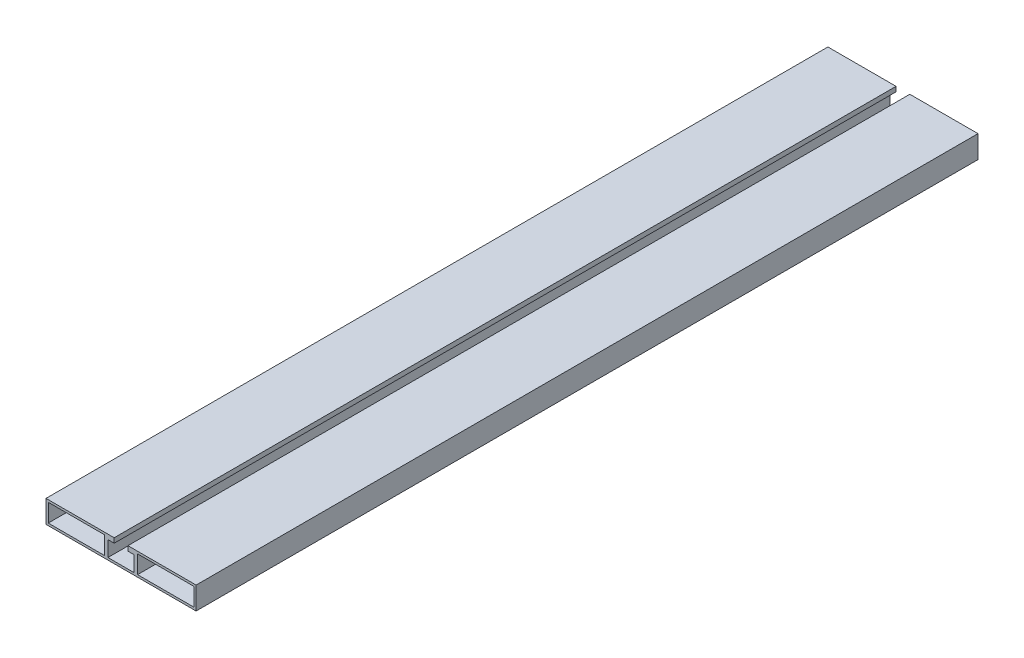
ISO-10303-21;
HEADER;
FILE_DESCRIPTION(('STEP AP214'),'2;1');
FILE_NAME('part.step','',(''),(''),'','','');
FILE_SCHEMA(('AUTOMOTIVE_DESIGN { 1 0 10303 214 1 1 1 1 }'));
ENDSEC;
DATA;
#1=APPLICATION_CONTEXT('core data for automotive mechanical design processes');
#2=APPLICATION_PROTOCOL_DEFINITION('international standard','automotive_design',2000,#1);
#3=PRODUCT_CONTEXT('',#1,'mechanical');
#4=PRODUCT('Part','Part','',(#3));
#5=PRODUCT_RELATED_PRODUCT_CATEGORY('part','',(#4));
#6=PRODUCT_DEFINITION_FORMATION('','',#4);
#7=PRODUCT_DEFINITION_CONTEXT('part definition',#1,'design');
#8=PRODUCT_DEFINITION('design','',#6,#7);
#9=PRODUCT_DEFINITION_SHAPE('','',#8);
#10=(LENGTH_UNIT() NAMED_UNIT(*) SI_UNIT(.MILLI.,.METRE.));
#11=(NAMED_UNIT(*) PLANE_ANGLE_UNIT() SI_UNIT($,.RADIAN.));
#12=(NAMED_UNIT(*) SI_UNIT($,.STERADIAN.) SOLID_ANGLE_UNIT());
#13=UNCERTAINTY_MEASURE_WITH_UNIT(LENGTH_MEASURE(1.E-05),#10,'distance_accuracy_value','');
#14=(GEOMETRIC_REPRESENTATION_CONTEXT(3) GLOBAL_UNCERTAINTY_ASSIGNED_CONTEXT((#13)) GLOBAL_UNIT_ASSIGNED_CONTEXT((#10,
#11,#12)) REPRESENTATION_CONTEXT('',''));
#15=CARTESIAN_POINT('',(0.,0.,0.));
#16=DIRECTION('',(0.,0.,1.));
#17=DIRECTION('',(1.,0.,0.));
#18=AXIS2_PLACEMENT_3D('',#15,#16,#17);
#19=CARTESIAN_POINT('',(59.9999999999999,-9.00000000000001,625.));
#20=DIRECTION('',(0.,1.,0.));
#21=DIRECTION('',(0.,0.,1.));
#22=AXIS2_PLACEMENT_3D('',#19,#20,#21);
#23=PLANE('',#22);
#24=CARTESIAN_POINT('',(0.,-9.00000000000001,603.));
#25=DIRECTION('',(0.,-1.,0.));
#26=DIRECTION('',(0.,0.,-1.));
#27=AXIS2_PLACEMENT_3D('',#24,#25,#26);
#28=CIRCLE('',#27,2.6);
#29=CARTESIAN_POINT('',(0.,-9.00000000000001,600.4));
#30=VERTEX_POINT('',#29);
#31=EDGE_CURVE('E663',#30,#30,#28,.T.);
#32=ORIENTED_EDGE('',*,*,#31,.F.);
#33=EDGE_LOOP('',(#32));
#34=FACE_BOUND('',#33,.T.);
#35=DIRECTION('',(1.,0.,0.));
#36=VECTOR('',#35,1.);
#37=CARTESIAN_POINT('',(59.9999999999999,-9.00000000000001,0.));
#38=LINE('',#37,#36);
#39=CARTESIAN_POINT('',(-60.0000000000001,-9.00000000000001,0.));
#40=VERTEX_POINT('',#39);
#41=CARTESIAN_POINT('',(59.9999999999999,-9.00000000000001,0.));
#42=VERTEX_POINT('',#41);
#43=EDGE_CURVE('E313',#40,#42,#38,.T.);
#44=ORIENTED_EDGE('',*,*,#43,.T.);
#45=DIRECTION('',(0.,0.,-1.));
#46=VECTOR('',#45,1.);
#47=CARTESIAN_POINT('',(59.9999999999999,-9.00000000000001,625.));
#48=LINE('',#47,#46);
#49=CARTESIAN_POINT('',(59.9999999999999,-9.00000000000001,625.));
#50=VERTEX_POINT('',#49);
#51=EDGE_CURVE('E48',#50,#42,#48,.T.);
#52=ORIENTED_EDGE('',*,*,#51,.F.);
#53=DIRECTION('',(1.,0.,0.));
#54=VECTOR('',#53,1.);
#55=CARTESIAN_POINT('',(59.9999999999999,-9.00000000000001,625.));
#56=LINE('',#55,#54);
#57=CARTESIAN_POINT('',(-60.0000000000001,-9.00000000000001,625.));
#58=VERTEX_POINT('',#57);
#59=EDGE_CURVE('E275',#58,#50,#56,.T.);
#60=ORIENTED_EDGE('',*,*,#59,.F.);
#61=DIRECTION('',(0.,0.,-1.));
#62=VECTOR('',#61,1.);
#63=CARTESIAN_POINT('',(-60.0000000000001,-9.00000000000001,625.));
#64=LINE('',#63,#62);
#65=EDGE_CURVE('E11',#58,#40,#64,.T.);
#66=ORIENTED_EDGE('',*,*,#65,.T.);
#67=EDGE_LOOP('',(#44,#52,#60,#66));
#68=FACE_BOUND('',#67,.T.);
#69=CARTESIAN_POINT('',(0.,-9.00000000000001,22.));
#70=DIRECTION('',(0.,-1.,0.));
#71=DIRECTION('',(0.,0.,-1.));
#72=AXIS2_PLACEMENT_3D('',#69,#70,#71);
#73=CIRCLE('',#72,2.6);
#74=CARTESIAN_POINT('',(0.,-9.00000000000001,19.4));
#75=VERTEX_POINT('',#74);
#76=EDGE_CURVE('E658',#75,#75,#73,.T.);
#77=ORIENTED_EDGE('',*,*,#76,.F.);
#78=EDGE_LOOP('',(#77));
#79=FACE_BOUND('',#78,.T.);
#80=ADVANCED_FACE('F39',(#34,#68,#79),#23,.F.);
#81=CARTESIAN_POINT('',(0.,0.,625.));
#82=DIRECTION('',(0.,0.,-1.));
#83=DIRECTION('',(-1.,0.,0.));
#84=AXIS2_PLACEMENT_3D('',#81,#82,#83);
#85=PLANE('',#84);
#86=DIRECTION('',(-1.,0.,0.));
#87=VECTOR('',#86,1.);
#88=CARTESIAN_POINT('',(-13.2000000000001,7.2,625.));
#89=LINE('',#88,#87);
#90=CARTESIAN_POINT('',(-13.2000000000001,7.2,625.));
#91=VERTEX_POINT('',#90);
#92=CARTESIAN_POINT('',(-58.2000000000001,7.2,625.));
#93=VERTEX_POINT('',#92);
#94=EDGE_CURVE('E228',#91,#93,#89,.T.);
#95=ORIENTED_EDGE('',*,*,#94,.F.);
#96=DIRECTION('',(0.,1.,0.));
#97=VECTOR('',#96,1.);
#98=CARTESIAN_POINT('',(-13.2000000000001,-7.2,625.));
#99=LINE('',#98,#97);
#100=CARTESIAN_POINT('',(-13.2000000000001,-7.2,625.));
#101=VERTEX_POINT('',#100);
#102=EDGE_CURVE('E239',#101,#91,#99,.T.);
#103=ORIENTED_EDGE('',*,*,#102,.F.);
#104=DIRECTION('',(1.,0.,0.));
#105=VECTOR('',#104,1.);
#106=CARTESIAN_POINT('',(-13.2000000000001,-7.2,625.));
#107=LINE('',#106,#105);
#108=CARTESIAN_POINT('',(-58.2000000000001,-7.2,625.));
#109=VERTEX_POINT('',#108);
#110=EDGE_CURVE('E235',#109,#101,#107,.T.);
#111=ORIENTED_EDGE('',*,*,#110,.F.);
#112=DIRECTION('',(0.,-1.,0.));
#113=VECTOR('',#112,1.);
#114=CARTESIAN_POINT('',(-58.2000000000001,-7.2,625.));
#115=LINE('',#114,#113);
#116=EDGE_CURVE('E231',#93,#109,#115,.T.);
#117=ORIENTED_EDGE('',*,*,#116,.F.);
#118=EDGE_LOOP('',(#95,#103,#111,#117));
#119=FACE_BOUND('',#118,.T.);
#120=DIRECTION('',(0.,-1.,0.));
#121=VECTOR('',#120,1.);
#122=CARTESIAN_POINT('',(-60.0000000000001,8.99999999999999,625.));
#123=LINE('',#122,#121);
#124=CARTESIAN_POINT('',(-60.0000000000001,8.99999999999999,625.));
#125=VERTEX_POINT('',#124);
#126=EDGE_CURVE('E271',#125,#58,#123,.T.);
#127=ORIENTED_EDGE('',*,*,#126,.T.);
#128=ORIENTED_EDGE('',*,*,#59,.T.);
#129=DIRECTION('',(0.,1.,0.));
#130=VECTOR('',#129,1.);
#131=CARTESIAN_POINT('',(60.,8.99999999999999,625.));
#132=LINE('',#131,#130);
#133=CARTESIAN_POINT('',(60.,8.99999999999999,625.));
#134=VERTEX_POINT('',#133);
#135=EDGE_CURVE('E279',#50,#134,#132,.T.);
#136=ORIENTED_EDGE('',*,*,#135,.T.);
#137=DIRECTION('',(-1.,0.,0.));
#138=VECTOR('',#137,1.);
#139=CARTESIAN_POINT('',(60.,8.99999999999999,625.));
#140=LINE('',#139,#138);
#141=CARTESIAN_POINT('',(5.49999999999992,9.,625.));
#142=VERTEX_POINT('',#141);
#143=EDGE_CURVE('E282',#134,#142,#140,.T.);
#144=ORIENTED_EDGE('',*,*,#143,.T.);
#145=DIRECTION('',(0.,-1.,0.));
#146=VECTOR('',#145,1.);
#147=CARTESIAN_POINT('',(5.49999999999992,9.,625.));
#148=LINE('',#147,#146);
#149=CARTESIAN_POINT('',(5.49999999999992,5.19999999999999,625.));
#150=VERTEX_POINT('',#149);
#151=EDGE_CURVE('E285',#142,#150,#148,.T.);
#152=ORIENTED_EDGE('',*,*,#151,.T.);
#153=DIRECTION('',(1.,0.,0.));
#154=VECTOR('',#153,1.);
#155=CARTESIAN_POINT('',(5.49999999999992,5.19999999999999,625.));
#156=LINE('',#155,#154);
#157=CARTESIAN_POINT('',(10.5,5.2,625.));
#158=VERTEX_POINT('',#157);
#159=EDGE_CURVE('E288',#150,#158,#156,.T.);
#160=ORIENTED_EDGE('',*,*,#159,.T.);
#161=DIRECTION('',(0.,-1.,0.));
#162=VECTOR('',#161,1.);
#163=CARTESIAN_POINT('',(10.5,5.2,625.));
#164=LINE('',#163,#162);
#165=CARTESIAN_POINT('',(10.5,-7.2,625.));
#166=VERTEX_POINT('',#165);
#167=EDGE_CURVE('E291',#158,#166,#164,.T.);
#168=ORIENTED_EDGE('',*,*,#167,.T.);
#169=DIRECTION('',(-1.,0.,0.));
#170=VECTOR('',#169,1.);
#171=CARTESIAN_POINT('',(-10.5000000000001,-7.2,625.));
#172=LINE('',#171,#170);
#173=CARTESIAN_POINT('',(-10.5000000000001,-7.2,625.));
#174=VERTEX_POINT('',#173);
#175=EDGE_CURVE('E294',#166,#174,#172,.T.);
#176=ORIENTED_EDGE('',*,*,#175,.T.);
#177=DIRECTION('',(0.,1.,0.));
#178=VECTOR('',#177,1.);
#179=CARTESIAN_POINT('',(-10.5000000000001,5.2,625.));
#180=LINE('',#179,#178);
#181=CARTESIAN_POINT('',(-10.5000000000001,5.2,625.));
#182=VERTEX_POINT('',#181);
#183=EDGE_CURVE('E297',#174,#182,#180,.T.);
#184=ORIENTED_EDGE('',*,*,#183,.T.);
#185=DIRECTION('',(1.,0.,0.));
#186=VECTOR('',#185,1.);
#187=CARTESIAN_POINT('',(-5.50000000000007,5.19999999999999,625.));
#188=LINE('',#187,#186);
#189=CARTESIAN_POINT('',(-5.50000000000007,5.19999999999999,625.));
#190=VERTEX_POINT('',#189);
#191=EDGE_CURVE('E300',#182,#190,#188,.T.);
#192=ORIENTED_EDGE('',*,*,#191,.T.);
#193=DIRECTION('',(0.,1.,0.));
#194=VECTOR('',#193,1.);
#195=CARTESIAN_POINT('',(-5.50000000000008,9.,625.));
#196=LINE('',#195,#194);
#197=CARTESIAN_POINT('',(-5.50000000000008,9.,625.));
#198=VERTEX_POINT('',#197);
#199=EDGE_CURVE('E303',#190,#198,#196,.T.);
#200=ORIENTED_EDGE('',*,*,#199,.T.);
#201=DIRECTION('',(-1.,0.,0.));
#202=VECTOR('',#201,1.);
#203=CARTESIAN_POINT('',(-5.50000000000008,9.,625.));
#204=LINE('',#203,#202);
#205=EDGE_CURVE('E306',#198,#125,#204,.T.);
#206=ORIENTED_EDGE('',*,*,#205,.T.);
#207=EDGE_LOOP('',(#127,#128,#136,#144,#152,#160,#168,#176,#184,#192,#200,#206));
#208=FACE_BOUND('',#207,.T.);
#209=DIRECTION('',(1.,0.,0.));
#210=VECTOR('',#209,1.);
#211=CARTESIAN_POINT('',(13.2,-7.2,625.));
#212=LINE('',#211,#210);
#213=CARTESIAN_POINT('',(13.2,-7.2,625.));
#214=VERTEX_POINT('',#213);
#215=CARTESIAN_POINT('',(58.1999999999999,-7.2,625.));
#216=VERTEX_POINT('',#215);
#217=EDGE_CURVE('E177',#214,#216,#212,.T.);
#218=ORIENTED_EDGE('',*,*,#217,.F.);
#219=DIRECTION('',(0.,-1.,0.));
#220=VECTOR('',#219,1.);
#221=CARTESIAN_POINT('',(13.2,-7.2,625.));
#222=LINE('',#221,#220);
#223=CARTESIAN_POINT('',(13.2,7.2,625.));
#224=VERTEX_POINT('',#223);
#225=EDGE_CURVE('E204',#224,#214,#222,.T.);
#226=ORIENTED_EDGE('',*,*,#225,.F.);
#227=DIRECTION('',(-1.,0.,0.));
#228=VECTOR('',#227,1.);
#229=CARTESIAN_POINT('',(13.2,7.2,625.));
#230=LINE('',#229,#228);
#231=CARTESIAN_POINT('',(58.1999999999999,7.2,625.));
#232=VERTEX_POINT('',#231);
#233=EDGE_CURVE('E200',#232,#224,#230,.T.);
#234=ORIENTED_EDGE('',*,*,#233,.F.);
#235=DIRECTION('',(0.,1.,0.));
#236=VECTOR('',#235,1.);
#237=CARTESIAN_POINT('',(58.1999999999999,-7.2,625.));
#238=LINE('',#237,#236);
#239=EDGE_CURVE('E186',#216,#232,#238,.T.);
#240=ORIENTED_EDGE('',*,*,#239,.F.);
#241=EDGE_LOOP('',(#218,#226,#234,#240));
#242=FACE_BOUND('',#241,.T.);
#243=ADVANCED_FACE('F199',(#119,#208,#242),#85,.F.);
#244=CARTESIAN_POINT('',(0.,0.,0.));
#245=DIRECTION('',(0.,0.,-1.));
#246=DIRECTION('',(-1.,0.,0.));
#247=AXIS2_PLACEMENT_3D('',#244,#245,#246);
#248=PLANE('',#247);
#249=DIRECTION('',(0.,-1.,0.));
#250=VECTOR('',#249,1.);
#251=CARTESIAN_POINT('',(-60.0000000000001,8.99999999999999,0.));
#252=LINE('',#251,#250);
#253=CARTESIAN_POINT('',(-60.0000000000001,8.99999999999999,0.));
#254=VERTEX_POINT('',#253);
#255=EDGE_CURVE('E270',#254,#40,#252,.T.);
#256=ORIENTED_EDGE('',*,*,#255,.F.);
#257=DIRECTION('',(-1.,0.,0.));
#258=VECTOR('',#257,1.);
#259=CARTESIAN_POINT('',(-5.50000000000008,9.,0.));
#260=LINE('',#259,#258);
#261=CARTESIAN_POINT('',(-5.50000000000008,9.,0.));
#262=VERTEX_POINT('',#261);
#263=EDGE_CURVE('E276',#262,#254,#260,.T.);
#264=ORIENTED_EDGE('',*,*,#263,.F.);
#265=DIRECTION('',(0.,1.,0.));
#266=VECTOR('',#265,1.);
#267=CARTESIAN_POINT('',(-5.50000000000008,9.,0.));
#268=LINE('',#267,#266);
#269=CARTESIAN_POINT('',(-5.50000000000007,5.19999999999999,0.));
#270=VERTEX_POINT('',#269);
#271=EDGE_CURVE('E340',#270,#262,#268,.T.);
#272=ORIENTED_EDGE('',*,*,#271,.F.);
#273=DIRECTION('',(1.,0.,0.));
#274=VECTOR('',#273,1.);
#275=CARTESIAN_POINT('',(-5.50000000000007,5.19999999999999,0.));
#276=LINE('',#275,#274);
#277=CARTESIAN_POINT('',(-10.5000000000001,5.2,0.));
#278=VERTEX_POINT('',#277);
#279=EDGE_CURVE('E337',#278,#270,#276,.T.);
#280=ORIENTED_EDGE('',*,*,#279,.F.);
#281=DIRECTION('',(0.,1.,0.));
#282=VECTOR('',#281,1.);
#283=CARTESIAN_POINT('',(-10.5000000000001,5.2,0.));
#284=LINE('',#283,#282);
#285=CARTESIAN_POINT('',(-10.5000000000001,-7.2,0.));
#286=VERTEX_POINT('',#285);
#287=EDGE_CURVE('E334',#286,#278,#284,.T.);
#288=ORIENTED_EDGE('',*,*,#287,.F.);
#289=DIRECTION('',(-1.,0.,0.));
#290=VECTOR('',#289,1.);
#291=CARTESIAN_POINT('',(-10.5000000000001,-7.2,0.));
#292=LINE('',#291,#290);
#293=CARTESIAN_POINT('',(10.5,-7.2,0.));
#294=VERTEX_POINT('',#293);
#295=EDGE_CURVE('E331',#294,#286,#292,.T.);
#296=ORIENTED_EDGE('',*,*,#295,.F.);
#297=DIRECTION('',(0.,-1.,0.));
#298=VECTOR('',#297,1.);
#299=CARTESIAN_POINT('',(10.5,5.2,0.));
#300=LINE('',#299,#298);
#301=CARTESIAN_POINT('',(10.5,5.2,0.));
#302=VERTEX_POINT('',#301);
#303=EDGE_CURVE('E328',#302,#294,#300,.T.);
#304=ORIENTED_EDGE('',*,*,#303,.F.);
#305=DIRECTION('',(1.,0.,0.));
#306=VECTOR('',#305,1.);
#307=CARTESIAN_POINT('',(5.49999999999992,5.19999999999999,0.));
#308=LINE('',#307,#306);
#309=CARTESIAN_POINT('',(5.49999999999992,5.19999999999999,0.));
#310=VERTEX_POINT('',#309);
#311=EDGE_CURVE('E325',#310,#302,#308,.T.);
#312=ORIENTED_EDGE('',*,*,#311,.F.);
#313=DIRECTION('',(0.,-1.,0.));
#314=VECTOR('',#313,1.);
#315=CARTESIAN_POINT('',(5.49999999999992,9.,0.));
#316=LINE('',#315,#314);
#317=CARTESIAN_POINT('',(5.49999999999992,9.,0.));
#318=VERTEX_POINT('',#317);
#319=EDGE_CURVE('E322',#318,#310,#316,.T.);
#320=ORIENTED_EDGE('',*,*,#319,.F.);
#321=DIRECTION('',(-1.,0.,0.));
#322=VECTOR('',#321,1.);
#323=CARTESIAN_POINT('',(60.,8.99999999999999,0.));
#324=LINE('',#323,#322);
#325=CARTESIAN_POINT('',(60.,8.99999999999999,0.));
#326=VERTEX_POINT('',#325);
#327=EDGE_CURVE('E319',#326,#318,#324,.T.);
#328=ORIENTED_EDGE('',*,*,#327,.F.);
#329=DIRECTION('',(0.,1.,0.));
#330=VECTOR('',#329,1.);
#331=CARTESIAN_POINT('',(60.,8.99999999999999,0.));
#332=LINE('',#331,#330);
#333=EDGE_CURVE('E316',#42,#326,#332,.T.);
#334=ORIENTED_EDGE('',*,*,#333,.F.);
#335=ORIENTED_EDGE('',*,*,#43,.F.);
#336=EDGE_LOOP('',(#256,#264,#272,#280,#288,#296,#304,#312,#320,#328,#334,#335));
#337=FACE_BOUND('',#336,.T.);
#338=DIRECTION('',(0.,1.,0.));
#339=VECTOR('',#338,1.);
#340=CARTESIAN_POINT('',(-13.2000000000001,-7.2,0.));
#341=LINE('',#340,#339);
#342=CARTESIAN_POINT('',(-13.2000000000001,-7.2,0.));
#343=VERTEX_POINT('',#342);
#344=CARTESIAN_POINT('',(-13.2000000000001,7.2,0.));
#345=VERTEX_POINT('',#344);
#346=EDGE_CURVE('E232',#343,#345,#341,.T.);
#347=ORIENTED_EDGE('',*,*,#346,.T.);
#348=DIRECTION('',(-1.,0.,0.));
#349=VECTOR('',#348,1.);
#350=CARTESIAN_POINT('',(-13.2000000000001,7.2,0.));
#351=LINE('',#350,#349);
#352=CARTESIAN_POINT('',(-58.2000000000001,7.2,0.));
#353=VERTEX_POINT('',#352);
#354=EDGE_CURVE('E195',#345,#353,#351,.T.);
#355=ORIENTED_EDGE('',*,*,#354,.T.);
#356=DIRECTION('',(0.,-1.,0.));
#357=VECTOR('',#356,1.);
#358=CARTESIAN_POINT('',(-58.2000000000001,-7.2,0.));
#359=LINE('',#358,#357);
#360=CARTESIAN_POINT('',(-58.2000000000001,-7.2,0.));
#361=VERTEX_POINT('',#360);
#362=EDGE_CURVE('E246',#353,#361,#359,.T.);
#363=ORIENTED_EDGE('',*,*,#362,.T.);
#364=DIRECTION('',(1.,0.,0.));
#365=VECTOR('',#364,1.);
#366=CARTESIAN_POINT('',(-13.2000000000001,-7.2,0.));
#367=LINE('',#366,#365);
#368=EDGE_CURVE('E250',#361,#343,#367,.T.);
#369=ORIENTED_EDGE('',*,*,#368,.T.);
#370=EDGE_LOOP('',(#347,#355,#363,#369));
#371=FACE_BOUND('',#370,.T.);
#372=DIRECTION('',(0.,-1.,0.));
#373=VECTOR('',#372,1.);
#374=CARTESIAN_POINT('',(13.2,-7.2,0.));
#375=LINE('',#374,#373);
#376=CARTESIAN_POINT('',(13.2,7.2,0.));
#377=VERTEX_POINT('',#376);
#378=CARTESIAN_POINT('',(13.2,-7.2,0.));
#379=VERTEX_POINT('',#378);
#380=EDGE_CURVE('E187',#377,#379,#375,.T.);
#381=ORIENTED_EDGE('',*,*,#380,.T.);
#382=DIRECTION('',(1.,0.,0.));
#383=VECTOR('',#382,1.);
#384=CARTESIAN_POINT('',(13.2,-7.2,0.));
#385=LINE('',#384,#383);
#386=CARTESIAN_POINT('',(58.1999999999999,-7.2,0.));
#387=VERTEX_POINT('',#386);
#388=EDGE_CURVE('E63',#379,#387,#385,.T.);
#389=ORIENTED_EDGE('',*,*,#388,.T.);
#390=DIRECTION('',(0.,1.,0.));
#391=VECTOR('',#390,1.);
#392=CARTESIAN_POINT('',(58.1999999999999,-7.2,0.));
#393=LINE('',#392,#391);
#394=CARTESIAN_POINT('',(58.1999999999999,7.2,0.));
#395=VERTEX_POINT('',#394);
#396=EDGE_CURVE('E193',#387,#395,#393,.T.);
#397=ORIENTED_EDGE('',*,*,#396,.T.);
#398=DIRECTION('',(-1.,0.,0.));
#399=VECTOR('',#398,1.);
#400=CARTESIAN_POINT('',(13.2,7.2,0.));
#401=LINE('',#400,#399);
#402=EDGE_CURVE('E215',#395,#377,#401,.T.);
#403=ORIENTED_EDGE('',*,*,#402,.T.);
#404=EDGE_LOOP('',(#381,#389,#397,#403));
#405=FACE_BOUND('',#404,.T.);
#406=ADVANCED_FACE('F395',(#337,#371,#405),#248,.T.);
#407=CARTESIAN_POINT('',(-60.0000000000001,8.99999999999999,625.));
#408=DIRECTION('',(1.,0.,0.));
#409=DIRECTION('',(0.,1.,0.));
#410=AXIS2_PLACEMENT_3D('',#407,#408,#409);
#411=PLANE('',#410);
#412=ORIENTED_EDGE('',*,*,#255,.T.);
#413=ORIENTED_EDGE('',*,*,#65,.F.);
#414=ORIENTED_EDGE('',*,*,#126,.F.);
#415=DIRECTION('',(0.,0.,-1.));
#416=VECTOR('',#415,1.);
#417=CARTESIAN_POINT('',(-60.0000000000001,8.99999999999999,625.));
#418=LINE('',#417,#416);
#419=EDGE_CURVE('E309',#125,#254,#418,.T.);
#420=ORIENTED_EDGE('',*,*,#419,.T.);
#421=EDGE_LOOP('',(#412,#413,#414,#420));
#422=FACE_BOUND('',#421,.T.);
#423=ADVANCED_FACE('F41',(#422),#411,.F.);
#424=CARTESIAN_POINT('',(60.,8.99999999999999,625.));
#425=DIRECTION('',(-1.,0.,0.));
#426=DIRECTION('',(0.,-1.,0.));
#427=AXIS2_PLACEMENT_3D('',#424,#425,#426);
#428=PLANE('',#427);
#429=ORIENTED_EDGE('',*,*,#333,.T.);
#430=DIRECTION('',(0.,0.,-1.));
#431=VECTOR('',#430,1.);
#432=CARTESIAN_POINT('',(60.,8.99999999999999,625.));
#433=LINE('',#432,#431);
#434=EDGE_CURVE('E380',#134,#326,#433,.T.);
#435=ORIENTED_EDGE('',*,*,#434,.F.);
#436=ORIENTED_EDGE('',*,*,#135,.F.);
#437=ORIENTED_EDGE('',*,*,#51,.T.);
#438=EDGE_LOOP('',(#429,#435,#436,#437));
#439=FACE_BOUND('',#438,.T.);
#440=ADVANCED_FACE('F389',(#439),#428,.F.);
#441=CARTESIAN_POINT('',(60.,8.99999999999999,625.));
#442=DIRECTION('',(0.,-1.,0.));
#443=DIRECTION('',(1.,0.,0.));
#444=AXIS2_PLACEMENT_3D('',#441,#442,#443);
#445=PLANE('',#444);
#446=ORIENTED_EDGE('',*,*,#327,.T.);
#447=DIRECTION('',(0.,0.,-1.));
#448=VECTOR('',#447,1.);
#449=CARTESIAN_POINT('',(5.49999999999992,9.,625.));
#450=LINE('',#449,#448);
#451=EDGE_CURVE('E376',#142,#318,#450,.T.);
#452=ORIENTED_EDGE('',*,*,#451,.F.);
#453=ORIENTED_EDGE('',*,*,#143,.F.);
#454=ORIENTED_EDGE('',*,*,#434,.T.);
#455=EDGE_LOOP('',(#446,#452,#453,#454));
#456=FACE_BOUND('',#455,.T.);
#457=ADVANCED_FACE('F401',(#456),#445,.F.);
#458=CARTESIAN_POINT('',(5.49999999999992,9.,625.));
#459=DIRECTION('',(1.,0.,0.));
#460=DIRECTION('',(0.,1.,0.));
#461=AXIS2_PLACEMENT_3D('',#458,#459,#460);
#462=PLANE('',#461);
#463=ORIENTED_EDGE('',*,*,#319,.T.);
#464=DIRECTION('',(0.,0.,-1.));
#465=VECTOR('',#464,1.);
#466=CARTESIAN_POINT('',(5.49999999999992,5.19999999999999,625.));
#467=LINE('',#466,#465);
#468=EDGE_CURVE('E372',#150,#310,#467,.T.);
#469=ORIENTED_EDGE('',*,*,#468,.F.);
#470=ORIENTED_EDGE('',*,*,#151,.F.);
#471=ORIENTED_EDGE('',*,*,#451,.T.);
#472=EDGE_LOOP('',(#463,#469,#470,#471));
#473=FACE_BOUND('',#472,.T.);
#474=ADVANCED_FACE('F405',(#473),#462,.F.);
#475=CARTESIAN_POINT('',(5.49999999999992,5.19999999999999,625.));
#476=DIRECTION('',(0.,1.,0.));
#477=DIRECTION('',(-1.,0.,0.));
#478=AXIS2_PLACEMENT_3D('',#475,#476,#477);
#479=PLANE('',#478);
#480=ORIENTED_EDGE('',*,*,#311,.T.);
#481=DIRECTION('',(0.,0.,-1.));
#482=VECTOR('',#481,1.);
#483=CARTESIAN_POINT('',(10.5,5.2,625.));
#484=LINE('',#483,#482);
#485=EDGE_CURVE('E368',#158,#302,#484,.T.);
#486=ORIENTED_EDGE('',*,*,#485,.F.);
#487=ORIENTED_EDGE('',*,*,#159,.F.);
#488=ORIENTED_EDGE('',*,*,#468,.T.);
#489=EDGE_LOOP('',(#480,#486,#487,#488));
#490=FACE_BOUND('',#489,.T.);
#491=ADVANCED_FACE('F445',(#490),#479,.F.);
#492=CARTESIAN_POINT('',(10.5,5.2,625.));
#493=DIRECTION('',(1.,0.,0.));
#494=DIRECTION('',(0.,1.,0.));
#495=AXIS2_PLACEMENT_3D('',#492,#493,#494);
#496=PLANE('',#495);
#497=ORIENTED_EDGE('',*,*,#303,.T.);
#498=DIRECTION('',(0.,0.,-1.));
#499=VECTOR('',#498,1.);
#500=CARTESIAN_POINT('',(10.5,-7.2,625.));
#501=LINE('',#500,#499);
#502=EDGE_CURVE('E364',#166,#294,#501,.T.);
#503=ORIENTED_EDGE('',*,*,#502,.F.);
#504=ORIENTED_EDGE('',*,*,#167,.F.);
#505=ORIENTED_EDGE('',*,*,#485,.T.);
#506=EDGE_LOOP('',(#497,#503,#504,#505));
#507=FACE_BOUND('',#506,.T.);
#508=ADVANCED_FACE('F443',(#507),#496,.F.);
#509=CARTESIAN_POINT('',(-10.5000000000001,-7.2,625.));
#510=DIRECTION('',(0.,-1.,0.));
#511=DIRECTION('',(0.,0.,-1.));
#512=AXIS2_PLACEMENT_3D('',#509,#510,#511);
#513=PLANE('',#512);
#514=CARTESIAN_POINT('',(0.,-7.2,22.));
#515=DIRECTION('',(0.,-1.,0.));
#516=DIRECTION('',(0.,0.,-1.));
#517=AXIS2_PLACEMENT_3D('',#514,#515,#516);
#518=CIRCLE('',#517,2.6);
#519=CARTESIAN_POINT('',(0.,-7.2,19.4));
#520=VERTEX_POINT('',#519);
#521=EDGE_CURVE('E661',#520,#520,#518,.T.);
#522=ORIENTED_EDGE('',*,*,#521,.T.);
#523=EDGE_LOOP('',(#522));
#524=FACE_BOUND('',#523,.T.);
#525=CARTESIAN_POINT('',(0.,-7.2,603.));
#526=DIRECTION('',(0.,-1.,0.));
#527=DIRECTION('',(0.,0.,-1.));
#528=AXIS2_PLACEMENT_3D('',#525,#526,#527);
#529=CIRCLE('',#528,2.6);
#530=CARTESIAN_POINT('',(0.,-7.2,600.4));
#531=VERTEX_POINT('',#530);
#532=EDGE_CURVE('E212',#531,#531,#529,.T.);
#533=ORIENTED_EDGE('',*,*,#532,.T.);
#534=EDGE_LOOP('',(#533));
#535=FACE_BOUND('',#534,.T.);
#536=ORIENTED_EDGE('',*,*,#295,.T.);
#537=DIRECTION('',(0.,0.,-1.));
#538=VECTOR('',#537,1.);
#539=CARTESIAN_POINT('',(-10.5000000000001,-7.2,625.));
#540=LINE('',#539,#538);
#541=EDGE_CURVE('E360',#174,#286,#540,.T.);
#542=ORIENTED_EDGE('',*,*,#541,.F.);
#543=ORIENTED_EDGE('',*,*,#175,.F.);
#544=ORIENTED_EDGE('',*,*,#502,.T.);
#545=EDGE_LOOP('',(#536,#542,#543,#544));
#546=FACE_BOUND('',#545,.T.);
#547=ADVANCED_FACE('F439',(#524,#535,#546),#513,.F.);
#548=CARTESIAN_POINT('',(-10.5000000000001,5.2,625.));
#549=DIRECTION('',(-1.,0.,0.));
#550=DIRECTION('',(0.,-1.,0.));
#551=AXIS2_PLACEMENT_3D('',#548,#549,#550);
#552=PLANE('',#551);
#553=ORIENTED_EDGE('',*,*,#287,.T.);
#554=DIRECTION('',(0.,0.,-1.));
#555=VECTOR('',#554,1.);
#556=CARTESIAN_POINT('',(-10.5000000000001,5.2,625.));
#557=LINE('',#556,#555);
#558=EDGE_CURVE('E356',#182,#278,#557,.T.);
#559=ORIENTED_EDGE('',*,*,#558,.F.);
#560=ORIENTED_EDGE('',*,*,#183,.F.);
#561=ORIENTED_EDGE('',*,*,#541,.T.);
#562=EDGE_LOOP('',(#553,#559,#560,#561));
#563=FACE_BOUND('',#562,.T.);
#564=ADVANCED_FACE('F434',(#563),#552,.F.);
#565=CARTESIAN_POINT('',(-5.50000000000007,5.19999999999999,625.));
#566=DIRECTION('',(0.,1.,0.));
#567=DIRECTION('',(-1.,0.,0.));
#568=AXIS2_PLACEMENT_3D('',#565,#566,#567);
#569=PLANE('',#568);
#570=ORIENTED_EDGE('',*,*,#279,.T.);
#571=DIRECTION('',(0.,0.,-1.));
#572=VECTOR('',#571,1.);
#573=CARTESIAN_POINT('',(-5.50000000000007,5.19999999999999,625.));
#574=LINE('',#573,#572);
#575=EDGE_CURVE('E352',#190,#270,#574,.T.);
#576=ORIENTED_EDGE('',*,*,#575,.F.);
#577=ORIENTED_EDGE('',*,*,#191,.F.);
#578=ORIENTED_EDGE('',*,*,#558,.T.);
#579=EDGE_LOOP('',(#570,#576,#577,#578));
#580=FACE_BOUND('',#579,.T.);
#581=ADVANCED_FACE('F428',(#580),#569,.F.);
#582=CARTESIAN_POINT('',(-5.50000000000008,9.,625.));
#583=DIRECTION('',(-1.,0.,0.));
#584=DIRECTION('',(0.,-1.,0.));
#585=AXIS2_PLACEMENT_3D('',#582,#583,#584);
#586=PLANE('',#585);
#587=ORIENTED_EDGE('',*,*,#271,.T.);
#588=DIRECTION('',(0.,0.,-1.));
#589=VECTOR('',#588,1.);
#590=CARTESIAN_POINT('',(-5.50000000000008,9.,625.));
#591=LINE('',#590,#589);
#592=EDGE_CURVE('E348',#198,#262,#591,.T.);
#593=ORIENTED_EDGE('',*,*,#592,.F.);
#594=ORIENTED_EDGE('',*,*,#199,.F.);
#595=ORIENTED_EDGE('',*,*,#575,.T.);
#596=EDGE_LOOP('',(#587,#593,#594,#595));
#597=FACE_BOUND('',#596,.T.);
#598=ADVANCED_FACE('F424',(#597),#586,.F.);
#599=CARTESIAN_POINT('',(-5.50000000000008,9.,625.));
#600=DIRECTION('',(0.,-1.,0.));
#601=DIRECTION('',(1.,0.,0.));
#602=AXIS2_PLACEMENT_3D('',#599,#600,#601);
#603=PLANE('',#602);
#604=ORIENTED_EDGE('',*,*,#263,.T.);
#605=ORIENTED_EDGE('',*,*,#419,.F.);
#606=ORIENTED_EDGE('',*,*,#205,.F.);
#607=ORIENTED_EDGE('',*,*,#592,.T.);
#608=EDGE_LOOP('',(#604,#605,#606,#607));
#609=FACE_BOUND('',#608,.T.);
#610=ADVANCED_FACE('F419',(#609),#603,.F.);
#611=CARTESIAN_POINT('',(-13.2000000000001,7.2,625.));
#612=DIRECTION('',(0.,-1.,0.));
#613=DIRECTION('',(1.,0.,0.));
#614=AXIS2_PLACEMENT_3D('',#611,#612,#613);
#615=PLANE('',#614);
#616=ORIENTED_EDGE('',*,*,#354,.F.);
#617=DIRECTION('',(0.,0.,-1.));
#618=VECTOR('',#617,1.);
#619=CARTESIAN_POINT('',(-13.2000000000001,7.2,625.));
#620=LINE('',#619,#618);
#621=EDGE_CURVE('E242',#91,#345,#620,.T.);
#622=ORIENTED_EDGE('',*,*,#621,.F.);
#623=ORIENTED_EDGE('',*,*,#94,.T.);
#624=DIRECTION('',(0.,0.,-1.));
#625=VECTOR('',#624,1.);
#626=CARTESIAN_POINT('',(-58.2000000000001,7.2,625.));
#627=LINE('',#626,#625);
#628=EDGE_CURVE('E266',#93,#353,#627,.T.);
#629=ORIENTED_EDGE('',*,*,#628,.T.);
#630=EDGE_LOOP('',(#616,#622,#623,#629));
#631=FACE_BOUND('',#630,.T.);
#632=ADVANCED_FACE('F520',(#631),#615,.T.);
#633=CARTESIAN_POINT('',(-58.2000000000001,-7.2,625.));
#634=DIRECTION('',(1.,0.,0.));
#635=DIRECTION('',(0.,0.,-1.));
#636=AXIS2_PLACEMENT_3D('',#633,#634,#635);
#637=PLANE('',#636);
#638=ORIENTED_EDGE('',*,*,#362,.F.);
#639=ORIENTED_EDGE('',*,*,#628,.F.);
#640=ORIENTED_EDGE('',*,*,#116,.T.);
#641=DIRECTION('',(0.,0.,-1.));
#642=VECTOR('',#641,1.);
#643=CARTESIAN_POINT('',(-58.2000000000001,-7.2,625.));
#644=LINE('',#643,#642);
#645=EDGE_CURVE('E263',#109,#361,#644,.T.);
#646=ORIENTED_EDGE('',*,*,#645,.T.);
#647=EDGE_LOOP('',(#638,#639,#640,#646));
#648=FACE_BOUND('',#647,.T.);
#649=ADVANCED_FACE('F529',(#648),#637,.T.);
#650=CARTESIAN_POINT('',(-13.2000000000001,-7.2,625.));
#651=DIRECTION('',(0.,1.,0.));
#652=DIRECTION('',(0.,0.,1.));
#653=AXIS2_PLACEMENT_3D('',#650,#651,#652);
#654=PLANE('',#653);
#655=ORIENTED_EDGE('',*,*,#368,.F.);
#656=ORIENTED_EDGE('',*,*,#645,.F.);
#657=ORIENTED_EDGE('',*,*,#110,.T.);
#658=DIRECTION('',(0.,0.,-1.));
#659=VECTOR('',#658,1.);
#660=CARTESIAN_POINT('',(-13.2000000000001,-7.2,625.));
#661=LINE('',#660,#659);
#662=EDGE_CURVE('E260',#101,#343,#661,.T.);
#663=ORIENTED_EDGE('',*,*,#662,.T.);
#664=EDGE_LOOP('',(#655,#656,#657,#663));
#665=FACE_BOUND('',#664,.T.);
#666=ADVANCED_FACE('F539',(#665),#654,.T.);
#667=CARTESIAN_POINT('',(-13.2000000000001,-7.2,625.));
#668=DIRECTION('',(-1.,0.,0.));
#669=DIRECTION('',(0.,0.,1.));
#670=AXIS2_PLACEMENT_3D('',#667,#668,#669);
#671=PLANE('',#670);
#672=ORIENTED_EDGE('',*,*,#346,.F.);
#673=ORIENTED_EDGE('',*,*,#662,.F.);
#674=ORIENTED_EDGE('',*,*,#102,.T.);
#675=ORIENTED_EDGE('',*,*,#621,.T.);
#676=EDGE_LOOP('',(#672,#673,#674,#675));
#677=FACE_BOUND('',#676,.T.);
#678=ADVANCED_FACE('F549',(#677),#671,.T.);
#679=CARTESIAN_POINT('',(13.2,-7.2,625.));
#680=DIRECTION('',(0.,1.,0.));
#681=DIRECTION('',(0.,0.,1.));
#682=AXIS2_PLACEMENT_3D('',#679,#680,#681);
#683=PLANE('',#682);
#684=ORIENTED_EDGE('',*,*,#388,.F.);
#685=DIRECTION('',(0.,0.,-1.));
#686=VECTOR('',#685,1.);
#687=CARTESIAN_POINT('',(13.2,-7.2,625.));
#688=LINE('',#687,#686);
#689=EDGE_CURVE('E181',#214,#379,#688,.T.);
#690=ORIENTED_EDGE('',*,*,#689,.F.);
#691=ORIENTED_EDGE('',*,*,#217,.T.);
#692=DIRECTION('',(0.,0.,-1.));
#693=VECTOR('',#692,1.);
#694=CARTESIAN_POINT('',(58.1999999999999,-7.2,625.));
#695=LINE('',#694,#693);
#696=EDGE_CURVE('E180',#216,#387,#695,.T.);
#697=ORIENTED_EDGE('',*,*,#696,.T.);
#698=EDGE_LOOP('',(#684,#690,#691,#697));
#699=FACE_BOUND('',#698,.T.);
#700=ADVANCED_FACE('F179',(#699),#683,.T.);
#701=CARTESIAN_POINT('',(58.1999999999999,-7.2,625.));
#702=DIRECTION('',(-1.,0.,0.));
#703=DIRECTION('',(0.,0.,1.));
#704=AXIS2_PLACEMENT_3D('',#701,#702,#703);
#705=PLANE('',#704);
#706=ORIENTED_EDGE('',*,*,#396,.F.);
#707=ORIENTED_EDGE('',*,*,#696,.F.);
#708=ORIENTED_EDGE('',*,*,#239,.T.);
#709=DIRECTION('',(0.,0.,-1.));
#710=VECTOR('',#709,1.);
#711=CARTESIAN_POINT('',(58.1999999999999,7.2,625.));
#712=LINE('',#711,#710);
#713=EDGE_CURVE('E196',#232,#395,#712,.T.);
#714=ORIENTED_EDGE('',*,*,#713,.T.);
#715=EDGE_LOOP('',(#706,#707,#708,#714));
#716=FACE_BOUND('',#715,.T.);
#717=ADVANCED_FACE('F190',(#716),#705,.T.);
#718=CARTESIAN_POINT('',(13.2,7.2,625.));
#719=DIRECTION('',(0.,-1.,0.));
#720=DIRECTION('',(1.,0.,0.));
#721=AXIS2_PLACEMENT_3D('',#718,#719,#720);
#722=PLANE('',#721);
#723=ORIENTED_EDGE('',*,*,#402,.F.);
#724=ORIENTED_EDGE('',*,*,#713,.F.);
#725=ORIENTED_EDGE('',*,*,#233,.T.);
#726=DIRECTION('',(0.,0.,-1.));
#727=VECTOR('',#726,1.);
#728=CARTESIAN_POINT('',(13.2,7.2,625.));
#729=LINE('',#728,#727);
#730=EDGE_CURVE('E55',#224,#377,#729,.T.);
#731=ORIENTED_EDGE('',*,*,#730,.T.);
#732=EDGE_LOOP('',(#723,#724,#725,#731));
#733=FACE_BOUND('',#732,.T.);
#734=ADVANCED_FACE('F576',(#733),#722,.T.);
#735=CARTESIAN_POINT('',(13.2,-7.2,625.));
#736=DIRECTION('',(1.,0.,0.));
#737=DIRECTION('',(0.,0.,-1.));
#738=AXIS2_PLACEMENT_3D('',#735,#736,#737);
#739=PLANE('',#738);
#740=ORIENTED_EDGE('',*,*,#380,.F.);
#741=ORIENTED_EDGE('',*,*,#730,.F.);
#742=ORIENTED_EDGE('',*,*,#225,.T.);
#743=ORIENTED_EDGE('',*,*,#689,.T.);
#744=EDGE_LOOP('',(#740,#741,#742,#743));
#745=FACE_BOUND('',#744,.T.);
#746=ADVANCED_FACE('F585',(#745),#739,.T.);
#747=CARTESIAN_POINT('',(0.,-9.00000000000001,603.));
#748=DIRECTION('',(0.,-1.,0.));
#749=DIRECTION('',(0.,0.,-1.));
#750=AXIS2_PLACEMENT_3D('',#747,#748,#749);
#751=CYLINDRICAL_SURFACE('',#750,2.6);
#752=ORIENTED_EDGE('',*,*,#31,.T.);
#753=EDGE_LOOP('',(#752));
#754=FACE_BOUND('',#753,.T.);
#755=ORIENTED_EDGE('',*,*,#532,.F.);
#756=EDGE_LOOP('',(#755));
#757=FACE_BOUND('',#756,.T.);
#758=ADVANCED_FACE('F594',(#754,#757),#751,.F.);
#759=CARTESIAN_POINT('',(0.,-9.00000000000001,22.));
#760=DIRECTION('',(0.,-1.,0.));
#761=DIRECTION('',(0.,0.,-1.));
#762=AXIS2_PLACEMENT_3D('',#759,#760,#761);
#763=CYLINDRICAL_SURFACE('',#762,2.6);
#764=ORIENTED_EDGE('',*,*,#76,.T.);
#765=EDGE_LOOP('',(#764));
#766=FACE_BOUND('',#765,.T.);
#767=ORIENTED_EDGE('',*,*,#521,.F.);
#768=EDGE_LOOP('',(#767));
#769=FACE_BOUND('',#768,.T.);
#770=ADVANCED_FACE('F615',(#766,#769),#763,.F.);
#771=CLOSED_SHELL('',(#80,#243,#406,#423,#440,#457,#474,#491,#508,#547,#564,#581,#598,#610,#632,
#649,#666,#678,#700,#717,#734,#746,#758,#770));
#772=MANIFOLD_SOLID_BREP('B2',#771);
#773=ADVANCED_BREP_SHAPE_REPRESENTATION('',(#18,#772),#14);
#774=SHAPE_DEFINITION_REPRESENTATION(#9,#773);
ENDSEC;
END-ISO-10303-21;
